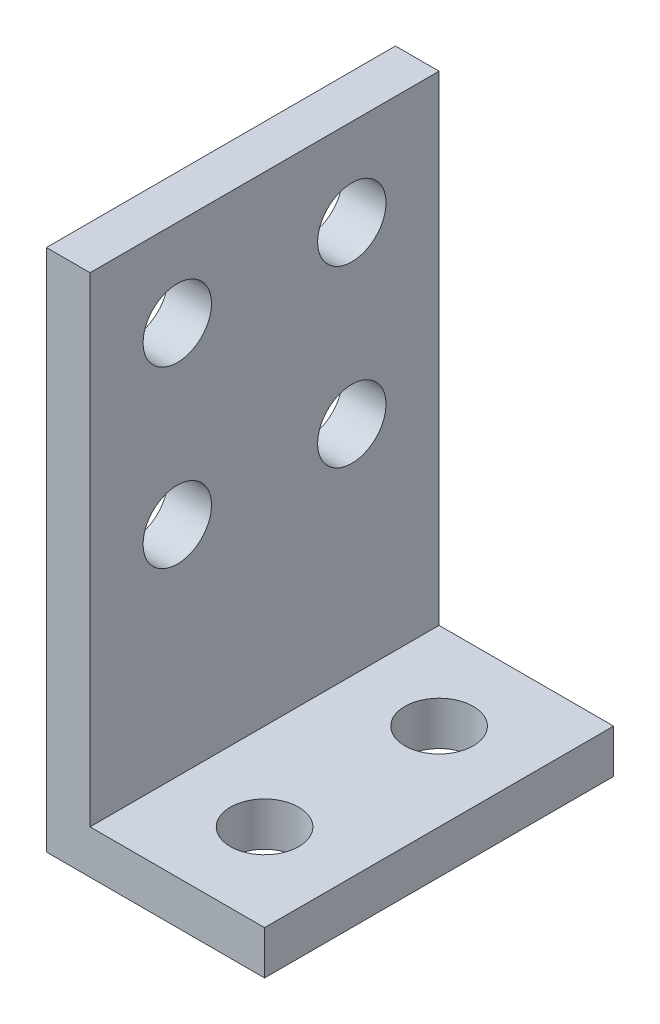
ISO-10303-21;
HEADER;
FILE_DESCRIPTION(('STEP AP214'),'2;1');
FILE_NAME('part.step','',(''),(''),'','','');
FILE_SCHEMA(('AUTOMOTIVE_DESIGN { 1 0 10303 214 1 1 1 1 }'));
ENDSEC;
DATA;
#1=APPLICATION_CONTEXT('core data for automotive mechanical design processes');
#2=APPLICATION_PROTOCOL_DEFINITION('international standard','automotive_design',2000,#1);
#3=PRODUCT_CONTEXT('',#1,'mechanical');
#4=PRODUCT('Part','Part','',(#3));
#5=PRODUCT_RELATED_PRODUCT_CATEGORY('part','',(#4));
#6=PRODUCT_DEFINITION_FORMATION('','',#4);
#7=PRODUCT_DEFINITION_CONTEXT('part definition',#1,'design');
#8=PRODUCT_DEFINITION('design','',#6,#7);
#9=PRODUCT_DEFINITION_SHAPE('','',#8);
#10=(LENGTH_UNIT() NAMED_UNIT(*) SI_UNIT(.MILLI.,.METRE.));
#11=(NAMED_UNIT(*) PLANE_ANGLE_UNIT() SI_UNIT($,.RADIAN.));
#12=(NAMED_UNIT(*) SI_UNIT($,.STERADIAN.) SOLID_ANGLE_UNIT());
#13=UNCERTAINTY_MEASURE_WITH_UNIT(LENGTH_MEASURE(1.E-05),#10,'distance_accuracy_value','');
#14=(GEOMETRIC_REPRESENTATION_CONTEXT(3) GLOBAL_UNCERTAINTY_ASSIGNED_CONTEXT((#13)) GLOBAL_UNIT_ASSIGNED_CONTEXT((#10,
#11,#12)) REPRESENTATION_CONTEXT('',''));
#15=CARTESIAN_POINT('',(0.,0.,0.));
#16=DIRECTION('',(0.,0.,1.));
#17=DIRECTION('',(1.,0.,0.));
#18=AXIS2_PLACEMENT_3D('',#15,#16,#17);
#19=CARTESIAN_POINT('',(15.875,0.,25.4));
#20=DIRECTION('',(0.,1.,0.));
#21=DIRECTION('',(-1.,0.,0.));
#22=AXIS2_PLACEMENT_3D('',#19,#20,#21);
#23=PLANE('',#22);
#24=CARTESIAN_POINT('',(9.525,0.,6.35));
#25=DIRECTION('',(0.,1.,0.));
#26=DIRECTION('',(0.,0.,1.));
#27=AXIS2_PLACEMENT_3D('',#24,#25,#26);
#28=CIRCLE('',#27,2.4892);
#29=CARTESIAN_POINT('',(9.525,0.,8.8392));
#30=VERTEX_POINT('',#29);
#31=EDGE_CURVE('E139',#30,#30,#28,.T.);
#32=ORIENTED_EDGE('',*,*,#31,.T.);
#33=EDGE_LOOP('',(#32));
#34=FACE_BOUND('',#33,.T.);
#35=CARTESIAN_POINT('',(9.525,0.,19.05));
#36=DIRECTION('',(0.,1.,0.));
#37=DIRECTION('',(0.,0.,1.));
#38=AXIS2_PLACEMENT_3D('',#35,#36,#37);
#39=CIRCLE('',#38,2.4892);
#40=CARTESIAN_POINT('',(9.525,0.,21.5392));
#41=VERTEX_POINT('',#40);
#42=EDGE_CURVE('E194',#41,#41,#39,.T.);
#43=ORIENTED_EDGE('',*,*,#42,.T.);
#44=EDGE_LOOP('',(#43));
#45=FACE_BOUND('',#44,.T.);
#46=DIRECTION('',(1.,0.,0.));
#47=VECTOR('',#46,1.);
#48=CARTESIAN_POINT('',(15.875,0.,0.));
#49=LINE('',#48,#47);
#50=CARTESIAN_POINT('',(0.,0.,0.));
#51=VERTEX_POINT('',#50);
#52=CARTESIAN_POINT('',(15.875,0.,0.));
#53=VERTEX_POINT('',#52);
#54=EDGE_CURVE('E134',#51,#53,#49,.T.);
#55=ORIENTED_EDGE('',*,*,#54,.T.);
#56=DIRECTION('',(0.,0.,-1.));
#57=VECTOR('',#56,1.);
#58=CARTESIAN_POINT('',(15.875,0.,25.4));
#59=LINE('',#58,#57);
#60=CARTESIAN_POINT('',(15.875,0.,25.4));
#61=VERTEX_POINT('',#60);
#62=EDGE_CURVE('E11',#61,#53,#59,.T.);
#63=ORIENTED_EDGE('',*,*,#62,.F.);
#64=DIRECTION('',(1.,0.,0.));
#65=VECTOR('',#64,1.);
#66=CARTESIAN_POINT('',(15.875,0.,25.4));
#67=LINE('',#66,#65);
#68=CARTESIAN_POINT('',(0.,0.,25.4));
#69=VERTEX_POINT('',#68);
#70=EDGE_CURVE('E151',#69,#61,#67,.T.);
#71=ORIENTED_EDGE('',*,*,#70,.F.);
#72=DIRECTION('',(0.,0.,-1.));
#73=VECTOR('',#72,1.);
#74=CARTESIAN_POINT('',(0.,0.,25.4));
#75=LINE('',#74,#73);
#76=EDGE_CURVE('E130',#69,#51,#75,.T.);
#77=ORIENTED_EDGE('',*,*,#76,.T.);
#78=EDGE_LOOP('',(#55,#63,#71,#77));
#79=FACE_BOUND('',#78,.T.);
#80=ADVANCED_FACE('F43',(#34,#45,#79),#23,.F.);
#81=CARTESIAN_POINT('',(15.875,3.175,25.4));
#82=DIRECTION('',(-1.,0.,0.));
#83=DIRECTION('',(0.,0.,1.));
#84=AXIS2_PLACEMENT_3D('',#81,#82,#83);
#85=PLANE('',#84);
#86=DIRECTION('',(0.,1.,0.));
#87=VECTOR('',#86,1.);
#88=CARTESIAN_POINT('',(15.875,3.175,0.));
#89=LINE('',#88,#87);
#90=CARTESIAN_POINT('',(15.875,3.175,0.));
#91=VERTEX_POINT('',#90);
#92=EDGE_CURVE('E138',#53,#91,#89,.T.);
#93=ORIENTED_EDGE('',*,*,#92,.T.);
#94=DIRECTION('',(0.,0.,-1.));
#95=VECTOR('',#94,1.);
#96=CARTESIAN_POINT('',(15.875,3.175,25.4));
#97=LINE('',#96,#95);
#98=CARTESIAN_POINT('',(15.875,3.175,25.4));
#99=VERTEX_POINT('',#98);
#100=EDGE_CURVE('E52',#99,#91,#97,.T.);
#101=ORIENTED_EDGE('',*,*,#100,.F.);
#102=DIRECTION('',(0.,1.,0.));
#103=VECTOR('',#102,1.);
#104=CARTESIAN_POINT('',(15.875,3.175,25.4));
#105=LINE('',#104,#103);
#106=EDGE_CURVE('E97',#61,#99,#105,.T.);
#107=ORIENTED_EDGE('',*,*,#106,.F.);
#108=ORIENTED_EDGE('',*,*,#62,.T.);
#109=EDGE_LOOP('',(#93,#101,#107,#108));
#110=FACE_BOUND('',#109,.T.);
#111=ADVANCED_FACE('F184',(#110),#85,.F.);
#112=CARTESIAN_POINT('',(3.175,3.175,25.4));
#113=DIRECTION('',(0.,-1.,0.));
#114=DIRECTION('',(0.,0.,-1.));
#115=AXIS2_PLACEMENT_3D('',#112,#113,#114);
#116=PLANE('',#115);
#117=CARTESIAN_POINT('',(9.525,3.175,6.35));
#118=DIRECTION('',(0.,1.,0.));
#119=DIRECTION('',(0.,0.,1.));
#120=AXIS2_PLACEMENT_3D('',#117,#118,#119);
#121=CIRCLE('',#120,2.4892);
#122=CARTESIAN_POINT('',(9.525,3.175,8.8392));
#123=VERTEX_POINT('',#122);
#124=EDGE_CURVE('E197',#123,#123,#121,.T.);
#125=ORIENTED_EDGE('',*,*,#124,.F.);
#126=EDGE_LOOP('',(#125));
#127=FACE_BOUND('',#126,.T.);
#128=CARTESIAN_POINT('',(9.525,3.175,19.05));
#129=DIRECTION('',(0.,1.,0.));
#130=DIRECTION('',(0.,0.,1.));
#131=AXIS2_PLACEMENT_3D('',#128,#129,#130);
#132=CIRCLE('',#131,2.4892);
#133=CARTESIAN_POINT('',(9.525,3.175,21.5392));
#134=VERTEX_POINT('',#133);
#135=EDGE_CURVE('E198',#134,#134,#132,.T.);
#136=ORIENTED_EDGE('',*,*,#135,.F.);
#137=EDGE_LOOP('',(#136));
#138=FACE_BOUND('',#137,.T.);
#139=DIRECTION('',(-1.,0.,0.));
#140=VECTOR('',#139,1.);
#141=CARTESIAN_POINT('',(3.175,3.175,0.));
#142=LINE('',#141,#140);
#143=CARTESIAN_POINT('',(3.175,3.175,0.));
#144=VERTEX_POINT('',#143);
#145=EDGE_CURVE('E142',#91,#144,#142,.T.);
#146=ORIENTED_EDGE('',*,*,#145,.T.);
#147=DIRECTION('',(0.,0.,-1.));
#148=VECTOR('',#147,1.);
#149=CARTESIAN_POINT('',(3.175,3.175,25.4));
#150=LINE('',#149,#148);
#151=CARTESIAN_POINT('',(3.175,3.175,25.4));
#152=VERTEX_POINT('',#151);
#153=EDGE_CURVE('E121',#152,#144,#150,.T.);
#154=ORIENTED_EDGE('',*,*,#153,.F.);
#155=DIRECTION('',(-1.,0.,0.));
#156=VECTOR('',#155,1.);
#157=CARTESIAN_POINT('',(3.175,3.175,25.4));
#158=LINE('',#157,#156);
#159=EDGE_CURVE('E110',#99,#152,#158,.T.);
#160=ORIENTED_EDGE('',*,*,#159,.F.);
#161=ORIENTED_EDGE('',*,*,#100,.T.);
#162=EDGE_LOOP('',(#146,#154,#160,#161));
#163=FACE_BOUND('',#162,.T.);
#164=ADVANCED_FACE('F163',(#127,#138,#163),#116,.F.);
#165=CARTESIAN_POINT('',(3.175,38.1,25.4));
#166=DIRECTION('',(-1.,0.,0.));
#167=DIRECTION('',(0.,-1.,0.));
#168=AXIS2_PLACEMENT_3D('',#165,#166,#167);
#169=PLANE('',#168);
#170=CARTESIAN_POINT('',(3.175,19.05,6.35));
#171=DIRECTION('',(-1.,0.,0.));
#172=DIRECTION('',(0.,-1.,0.));
#173=AXIS2_PLACEMENT_3D('',#170,#171,#172);
#174=CIRCLE('',#173,2.4892);
#175=CARTESIAN_POINT('',(3.175,16.5608,6.35));
#176=VERTEX_POINT('',#175);
#177=EDGE_CURVE('E207',#176,#176,#174,.T.);
#178=ORIENTED_EDGE('',*,*,#177,.T.);
#179=EDGE_LOOP('',(#178));
#180=FACE_BOUND('',#179,.T.);
#181=CARTESIAN_POINT('',(3.175,19.05,19.05));
#182=DIRECTION('',(-1.,0.,0.));
#183=DIRECTION('',(0.,-1.,0.));
#184=AXIS2_PLACEMENT_3D('',#181,#182,#183);
#185=CIRCLE('',#184,2.4892);
#186=CARTESIAN_POINT('',(3.175,16.5608,19.05));
#187=VERTEX_POINT('',#186);
#188=EDGE_CURVE('E246',#187,#187,#185,.T.);
#189=ORIENTED_EDGE('',*,*,#188,.T.);
#190=EDGE_LOOP('',(#189));
#191=FACE_BOUND('',#190,.T.);
#192=CARTESIAN_POINT('',(3.175,31.75,19.05));
#193=DIRECTION('',(-1.,0.,0.));
#194=DIRECTION('',(0.,-1.,0.));
#195=AXIS2_PLACEMENT_3D('',#192,#193,#194);
#196=CIRCLE('',#195,2.4892);
#197=CARTESIAN_POINT('',(3.175,29.2608,19.05));
#198=VERTEX_POINT('',#197);
#199=EDGE_CURVE('E252',#198,#198,#196,.T.);
#200=ORIENTED_EDGE('',*,*,#199,.T.);
#201=EDGE_LOOP('',(#200));
#202=FACE_BOUND('',#201,.T.);
#203=CARTESIAN_POINT('',(3.175,31.75,6.35));
#204=DIRECTION('',(-1.,0.,0.));
#205=DIRECTION('',(0.,-1.,0.));
#206=AXIS2_PLACEMENT_3D('',#203,#204,#205);
#207=CIRCLE('',#206,2.4892);
#208=CARTESIAN_POINT('',(3.175,29.2608,6.35));
#209=VERTEX_POINT('',#208);
#210=EDGE_CURVE('E258',#209,#209,#207,.T.);
#211=ORIENTED_EDGE('',*,*,#210,.T.);
#212=EDGE_LOOP('',(#211));
#213=FACE_BOUND('',#212,.T.);
#214=DIRECTION('',(0.,1.,0.));
#215=VECTOR('',#214,1.);
#216=CARTESIAN_POINT('',(3.175,38.1,0.));
#217=LINE('',#216,#215);
#218=CARTESIAN_POINT('',(3.175,38.1,0.));
#219=VERTEX_POINT('',#218);
#220=EDGE_CURVE('E119',#144,#219,#217,.T.);
#221=ORIENTED_EDGE('',*,*,#220,.T.);
#222=DIRECTION('',(0.,0.,-1.));
#223=VECTOR('',#222,1.);
#224=CARTESIAN_POINT('',(3.175,38.1,25.4));
#225=LINE('',#224,#223);
#226=CARTESIAN_POINT('',(3.175,38.1,25.4));
#227=VERTEX_POINT('',#226);
#228=EDGE_CURVE('E116',#227,#219,#225,.T.);
#229=ORIENTED_EDGE('',*,*,#228,.F.);
#230=DIRECTION('',(0.,1.,0.));
#231=VECTOR('',#230,1.);
#232=CARTESIAN_POINT('',(3.175,38.1,25.4));
#233=LINE('',#232,#231);
#234=EDGE_CURVE('E104',#152,#227,#233,.T.);
#235=ORIENTED_EDGE('',*,*,#234,.F.);
#236=ORIENTED_EDGE('',*,*,#153,.T.);
#237=EDGE_LOOP('',(#221,#229,#235,#236));
#238=FACE_BOUND('',#237,.T.);
#239=ADVANCED_FACE('F117',(#180,#191,#202,#213,#238),#169,.F.);
#240=CARTESIAN_POINT('',(0.,38.1,25.4));
#241=DIRECTION('',(0.,-1.,0.));
#242=DIRECTION('',(0.,0.,-1.));
#243=AXIS2_PLACEMENT_3D('',#240,#241,#242);
#244=PLANE('',#243);
#245=DIRECTION('',(-1.,0.,0.));
#246=VECTOR('',#245,1.);
#247=CARTESIAN_POINT('',(0.,38.1,0.));
#248=LINE('',#247,#246);
#249=CARTESIAN_POINT('',(0.,38.1,0.));
#250=VERTEX_POINT('',#249);
#251=EDGE_CURVE('E83',#219,#250,#248,.T.);
#252=ORIENTED_EDGE('',*,*,#251,.T.);
#253=DIRECTION('',(0.,0.,-1.));
#254=VECTOR('',#253,1.);
#255=CARTESIAN_POINT('',(0.,38.1,25.4));
#256=LINE('',#255,#254);
#257=CARTESIAN_POINT('',(0.,38.1,25.4));
#258=VERTEX_POINT('',#257);
#259=EDGE_CURVE('E122',#258,#250,#256,.T.);
#260=ORIENTED_EDGE('',*,*,#259,.F.);
#261=DIRECTION('',(-1.,0.,0.));
#262=VECTOR('',#261,1.);
#263=CARTESIAN_POINT('',(0.,38.1,25.4));
#264=LINE('',#263,#262);
#265=EDGE_CURVE('E108',#227,#258,#264,.T.);
#266=ORIENTED_EDGE('',*,*,#265,.F.);
#267=ORIENTED_EDGE('',*,*,#228,.T.);
#268=EDGE_LOOP('',(#252,#260,#266,#267));
#269=FACE_BOUND('',#268,.T.);
#270=ADVANCED_FACE('F124',(#269),#244,.F.);
#271=CARTESIAN_POINT('',(0.,0.,25.4));
#272=DIRECTION('',(1.,0.,0.));
#273=DIRECTION('',(0.,0.,-1.));
#274=AXIS2_PLACEMENT_3D('',#271,#272,#273);
#275=PLANE('',#274);
#276=CARTESIAN_POINT('',(0.,19.05,6.35));
#277=DIRECTION('',(-1.,0.,0.));
#278=DIRECTION('',(0.,0.,1.));
#279=AXIS2_PLACEMENT_3D('',#276,#277,#278);
#280=CIRCLE('',#279,2.4892);
#281=CARTESIAN_POINT('',(0.,19.05,8.8392));
#282=VERTEX_POINT('',#281);
#283=EDGE_CURVE('E282',#282,#282,#280,.T.);
#284=ORIENTED_EDGE('',*,*,#283,.F.);
#285=EDGE_LOOP('',(#284));
#286=FACE_BOUND('',#285,.T.);
#287=CARTESIAN_POINT('',(0.,19.05,19.05));
#288=DIRECTION('',(-1.,0.,0.));
#289=DIRECTION('',(0.,0.,1.));
#290=AXIS2_PLACEMENT_3D('',#287,#288,#289);
#291=CIRCLE('',#290,2.4892);
#292=CARTESIAN_POINT('',(0.,19.05,21.5392));
#293=VERTEX_POINT('',#292);
#294=EDGE_CURVE('E276',#293,#293,#291,.T.);
#295=ORIENTED_EDGE('',*,*,#294,.F.);
#296=EDGE_LOOP('',(#295));
#297=FACE_BOUND('',#296,.T.);
#298=CARTESIAN_POINT('',(0.,31.75,19.05));
#299=DIRECTION('',(-1.,0.,0.));
#300=DIRECTION('',(0.,0.,1.));
#301=AXIS2_PLACEMENT_3D('',#298,#299,#300);
#302=CIRCLE('',#301,2.4892);
#303=CARTESIAN_POINT('',(0.,31.75,21.5392));
#304=VERTEX_POINT('',#303);
#305=EDGE_CURVE('E270',#304,#304,#302,.T.);
#306=ORIENTED_EDGE('',*,*,#305,.F.);
#307=EDGE_LOOP('',(#306));
#308=FACE_BOUND('',#307,.T.);
#309=CARTESIAN_POINT('',(0.,31.75,6.35));
#310=DIRECTION('',(-1.,0.,0.));
#311=DIRECTION('',(0.,0.,1.));
#312=AXIS2_PLACEMENT_3D('',#309,#310,#311);
#313=CIRCLE('',#312,2.4892);
#314=CARTESIAN_POINT('',(0.,31.75,8.8392));
#315=VERTEX_POINT('',#314);
#316=EDGE_CURVE('E264',#315,#315,#313,.T.);
#317=ORIENTED_EDGE('',*,*,#316,.F.);
#318=EDGE_LOOP('',(#317));
#319=FACE_BOUND('',#318,.T.);
#320=DIRECTION('',(0.,-1.,0.));
#321=VECTOR('',#320,1.);
#322=CARTESIAN_POINT('',(0.,0.,0.));
#323=LINE('',#322,#321);
#324=EDGE_CURVE('E89',#250,#51,#323,.T.);
#325=ORIENTED_EDGE('',*,*,#324,.T.);
#326=ORIENTED_EDGE('',*,*,#76,.F.);
#327=DIRECTION('',(0.,-1.,0.));
#328=VECTOR('',#327,1.);
#329=CARTESIAN_POINT('',(0.,0.,25.4));
#330=LINE('',#329,#328);
#331=EDGE_CURVE('E60',#258,#69,#330,.T.);
#332=ORIENTED_EDGE('',*,*,#331,.F.);
#333=ORIENTED_EDGE('',*,*,#259,.T.);
#334=EDGE_LOOP('',(#325,#326,#332,#333));
#335=FACE_BOUND('',#334,.T.);
#336=ADVANCED_FACE('F170',(#286,#297,#308,#319,#335),#275,.F.);
#337=CARTESIAN_POINT('',(0.,0.,25.4));
#338=DIRECTION('',(0.,0.,-1.));
#339=DIRECTION('',(-1.,0.,0.));
#340=AXIS2_PLACEMENT_3D('',#337,#338,#339);
#341=PLANE('',#340);
#342=ORIENTED_EDGE('',*,*,#70,.T.);
#343=ORIENTED_EDGE('',*,*,#106,.T.);
#344=ORIENTED_EDGE('',*,*,#159,.T.);
#345=ORIENTED_EDGE('',*,*,#234,.T.);
#346=ORIENTED_EDGE('',*,*,#265,.T.);
#347=ORIENTED_EDGE('',*,*,#331,.T.);
#348=EDGE_LOOP('',(#342,#343,#344,#345,#346,#347));
#349=FACE_BOUND('',#348,.T.);
#350=ADVANCED_FACE('F106',(#349),#341,.F.);
#351=CARTESIAN_POINT('',(0.,0.,0.));
#352=DIRECTION('',(0.,0.,-1.));
#353=DIRECTION('',(-1.,0.,0.));
#354=AXIS2_PLACEMENT_3D('',#351,#352,#353);
#355=PLANE('',#354);
#356=ORIENTED_EDGE('',*,*,#54,.F.);
#357=ORIENTED_EDGE('',*,*,#324,.F.);
#358=ORIENTED_EDGE('',*,*,#251,.F.);
#359=ORIENTED_EDGE('',*,*,#220,.F.);
#360=ORIENTED_EDGE('',*,*,#145,.F.);
#361=ORIENTED_EDGE('',*,*,#92,.F.);
#362=EDGE_LOOP('',(#356,#357,#358,#359,#360,#361));
#363=FACE_BOUND('',#362,.T.);
#364=ADVANCED_FACE('F166',(#363),#355,.T.);
#365=CARTESIAN_POINT('',(9.525,0.,19.05));
#366=DIRECTION('',(0.,1.,0.));
#367=DIRECTION('',(0.,0.,1.));
#368=AXIS2_PLACEMENT_3D('',#365,#366,#367);
#369=CYLINDRICAL_SURFACE('',#368,2.4892);
#370=ORIENTED_EDGE('',*,*,#42,.F.);
#371=EDGE_LOOP('',(#370));
#372=FACE_BOUND('',#371,.T.);
#373=ORIENTED_EDGE('',*,*,#135,.T.);
#374=EDGE_LOOP('',(#373));
#375=FACE_BOUND('',#374,.T.);
#376=ADVANCED_FACE('F318',(#372,#375),#369,.F.);
#377=CARTESIAN_POINT('',(9.525,0.,6.35));
#378=DIRECTION('',(0.,1.,0.));
#379=DIRECTION('',(0.,0.,1.));
#380=AXIS2_PLACEMENT_3D('',#377,#378,#379);
#381=CYLINDRICAL_SURFACE('',#380,2.4892);
#382=ORIENTED_EDGE('',*,*,#31,.F.);
#383=EDGE_LOOP('',(#382));
#384=FACE_BOUND('',#383,.T.);
#385=ORIENTED_EDGE('',*,*,#124,.T.);
#386=EDGE_LOOP('',(#385));
#387=FACE_BOUND('',#386,.T.);
#388=ADVANCED_FACE('F309',(#384,#387),#381,.F.);
#389=CARTESIAN_POINT('',(15.875,31.75,6.35));
#390=DIRECTION('',(-1.,0.,0.));
#391=DIRECTION('',(0.,0.,1.));
#392=AXIS2_PLACEMENT_3D('',#389,#390,#391);
#393=CYLINDRICAL_SURFACE('',#392,2.4892);
#394=ORIENTED_EDGE('',*,*,#316,.T.);
#395=EDGE_LOOP('',(#394));
#396=FACE_BOUND('',#395,.T.);
#397=ORIENTED_EDGE('',*,*,#210,.F.);
#398=EDGE_LOOP('',(#397));
#399=FACE_BOUND('',#398,.T.);
#400=ADVANCED_FACE('F306',(#396,#399),#393,.F.);
#401=CARTESIAN_POINT('',(15.875,31.75,19.05));
#402=DIRECTION('',(-1.,0.,0.));
#403=DIRECTION('',(0.,0.,1.));
#404=AXIS2_PLACEMENT_3D('',#401,#402,#403);
#405=CYLINDRICAL_SURFACE('',#404,2.4892);
#406=ORIENTED_EDGE('',*,*,#305,.T.);
#407=EDGE_LOOP('',(#406));
#408=FACE_BOUND('',#407,.T.);
#409=ORIENTED_EDGE('',*,*,#199,.F.);
#410=EDGE_LOOP('',(#409));
#411=FACE_BOUND('',#410,.T.);
#412=ADVANCED_FACE('F308',(#408,#411),#405,.F.);
#413=CARTESIAN_POINT('',(15.875,19.05,19.05));
#414=DIRECTION('',(-1.,0.,0.));
#415=DIRECTION('',(0.,0.,1.));
#416=AXIS2_PLACEMENT_3D('',#413,#414,#415);
#417=CYLINDRICAL_SURFACE('',#416,2.4892);
#418=ORIENTED_EDGE('',*,*,#294,.T.);
#419=EDGE_LOOP('',(#418));
#420=FACE_BOUND('',#419,.T.);
#421=ORIENTED_EDGE('',*,*,#188,.F.);
#422=EDGE_LOOP('',(#421));
#423=FACE_BOUND('',#422,.T.);
#424=ADVANCED_FACE('F293',(#420,#423),#417,.F.);
#425=CARTESIAN_POINT('',(15.875,19.05,6.35));
#426=DIRECTION('',(-1.,0.,0.));
#427=DIRECTION('',(0.,0.,1.));
#428=AXIS2_PLACEMENT_3D('',#425,#426,#427);
#429=CYLINDRICAL_SURFACE('',#428,2.4892);
#430=ORIENTED_EDGE('',*,*,#283,.T.);
#431=EDGE_LOOP('',(#430));
#432=FACE_BOUND('',#431,.T.);
#433=ORIENTED_EDGE('',*,*,#177,.F.);
#434=EDGE_LOOP('',(#433));
#435=FACE_BOUND('',#434,.T.);
#436=ADVANCED_FACE('F290',(#432,#435),#429,.F.);
#437=CLOSED_SHELL('',(#80,#111,#164,#239,#270,#336,#350,#364,#376,#388,#400,#412,#424,#436));
#438=MANIFOLD_SOLID_BREP('B2',#437);
#439=ADVANCED_BREP_SHAPE_REPRESENTATION('',(#18,#438),#14);
#440=SHAPE_DEFINITION_REPRESENTATION(#9,#439);
ENDSEC;
END-ISO-10303-21;
